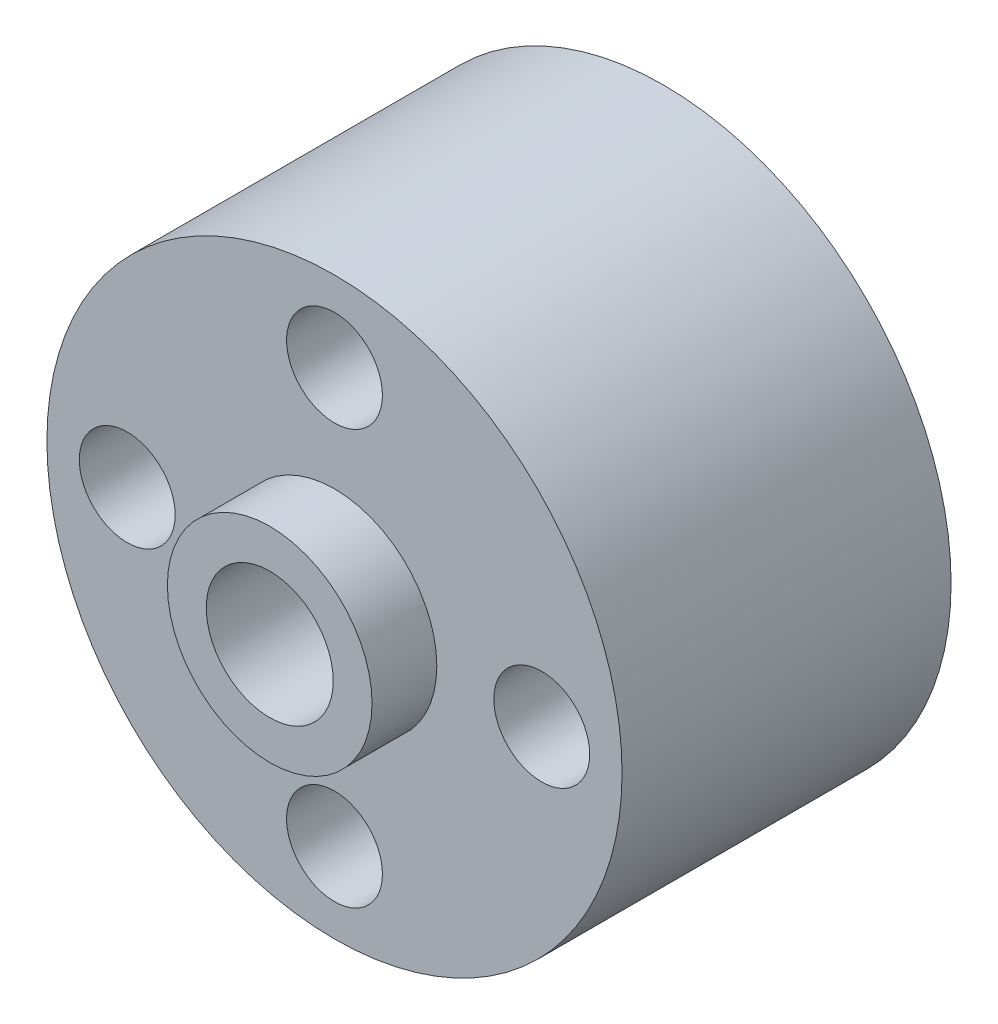
ISO-10303-21;
HEADER;
FILE_DESCRIPTION(('STEP AP214'),'2;1');
FILE_NAME('part.step','',(''),(''),'','','');
FILE_SCHEMA(('AUTOMOTIVE_DESIGN { 1 0 10303 214 1 1 1 1 }'));
ENDSEC;
DATA;
#1=APPLICATION_CONTEXT('core data for automotive mechanical design processes');
#2=APPLICATION_PROTOCOL_DEFINITION('international standard','automotive_design',2000,#1);
#3=PRODUCT_CONTEXT('',#1,'mechanical');
#4=PRODUCT('Part','Part','',(#3));
#5=PRODUCT_RELATED_PRODUCT_CATEGORY('part','',(#4));
#6=PRODUCT_DEFINITION_FORMATION('','',#4);
#7=PRODUCT_DEFINITION_CONTEXT('part definition',#1,'design');
#8=PRODUCT_DEFINITION('design','',#6,#7);
#9=PRODUCT_DEFINITION_SHAPE('','',#8);
#10=(LENGTH_UNIT() NAMED_UNIT(*) SI_UNIT(.MILLI.,.METRE.));
#11=(NAMED_UNIT(*) PLANE_ANGLE_UNIT() SI_UNIT($,.RADIAN.));
#12=(NAMED_UNIT(*) SI_UNIT($,.STERADIAN.) SOLID_ANGLE_UNIT());
#13=UNCERTAINTY_MEASURE_WITH_UNIT(LENGTH_MEASURE(1.E-05),#10,'distance_accuracy_value','');
#14=(GEOMETRIC_REPRESENTATION_CONTEXT(3) GLOBAL_UNCERTAINTY_ASSIGNED_CONTEXT((#13)) GLOBAL_UNIT_ASSIGNED_CONTEXT((#10,
#11,#12)) REPRESENTATION_CONTEXT('',''));
#15=CARTESIAN_POINT('',(0.,0.,0.));
#16=DIRECTION('',(0.,0.,1.));
#17=DIRECTION('',(1.,0.,0.));
#18=AXIS2_PLACEMENT_3D('',#15,#16,#17);
#19=CARTESIAN_POINT('',(0.,0.,-12.7));
#20=DIRECTION('',(0.,0.,1.));
#21=DIRECTION('',(1.,0.,0.));
#22=AXIS2_PLACEMENT_3D('',#19,#20,#21);
#23=PLANE('',#22);
#24=CARTESIAN_POINT('',(0.,0.,-12.7));
#25=DIRECTION('',(0.,0.,1.));
#26=DIRECTION('',(1.,0.,0.));
#27=AXIS2_PLACEMENT_3D('',#24,#25,#26);
#28=CIRCLE('',#27,11.1);
#29=CARTESIAN_POINT('',(11.1,0.,-12.7));
#30=VERTEX_POINT('',#29);
#31=EDGE_CURVE('E36',#30,#30,#28,.T.);
#32=ORIENTED_EDGE('',*,*,#31,.F.);
#33=EDGE_LOOP('',(#32));
#34=FACE_BOUND('',#33,.T.);
#35=CARTESIAN_POINT('',(8.,0.,-12.7));
#36=DIRECTION('',(0.,0.,1.));
#37=DIRECTION('',(1.,0.,0.));
#38=AXIS2_PLACEMENT_3D('',#35,#36,#37);
#39=CIRCLE('',#38,1.85);
#40=CARTESIAN_POINT('',(9.85,0.,-12.7));
#41=VERTEX_POINT('',#40);
#42=EDGE_CURVE('E45',#41,#41,#39,.T.);
#43=ORIENTED_EDGE('',*,*,#42,.T.);
#44=EDGE_LOOP('',(#43));
#45=FACE_BOUND('',#44,.T.);
#46=CARTESIAN_POINT('',(-8.,0.,-12.7));
#47=DIRECTION('',(0.,0.,1.));
#48=DIRECTION('',(1.,0.,0.));
#49=AXIS2_PLACEMENT_3D('',#46,#47,#48);
#50=CIRCLE('',#49,1.85);
#51=CARTESIAN_POINT('',(-6.15,0.,-12.7));
#52=VERTEX_POINT('',#51);
#53=EDGE_CURVE('E50',#52,#52,#50,.T.);
#54=ORIENTED_EDGE('',*,*,#53,.T.);
#55=EDGE_LOOP('',(#54));
#56=FACE_BOUND('',#55,.T.);
#57=CARTESIAN_POINT('',(0.,-8.,-12.7));
#58=DIRECTION('',(0.,0.,1.));
#59=DIRECTION('',(1.,0.,0.));
#60=AXIS2_PLACEMENT_3D('',#57,#58,#59);
#61=CIRCLE('',#60,1.85);
#62=CARTESIAN_POINT('',(1.85,-8.,-12.7));
#63=VERTEX_POINT('',#62);
#64=EDGE_CURVE('E56',#63,#63,#61,.T.);
#65=ORIENTED_EDGE('',*,*,#64,.T.);
#66=EDGE_LOOP('',(#65));
#67=FACE_BOUND('',#66,.T.);
#68=CARTESIAN_POINT('',(0.,8.,-12.7));
#69=DIRECTION('',(0.,0.,1.));
#70=DIRECTION('',(1.,0.,0.));
#71=AXIS2_PLACEMENT_3D('',#68,#69,#70);
#72=CIRCLE('',#71,1.85);
#73=CARTESIAN_POINT('',(1.85,8.,-12.7));
#74=VERTEX_POINT('',#73);
#75=EDGE_CURVE('E62',#74,#74,#72,.T.);
#76=ORIENTED_EDGE('',*,*,#75,.T.);
#77=EDGE_LOOP('',(#76));
#78=FACE_BOUND('',#77,.T.);
#79=CARTESIAN_POINT('',(0.,0.,-12.7));
#80=DIRECTION('',(0.,0.,1.));
#81=DIRECTION('',(1.,0.,0.));
#82=AXIS2_PLACEMENT_3D('',#79,#80,#81);
#83=CIRCLE('',#82,3.95);
#84=CARTESIAN_POINT('',(3.95,0.,-12.7));
#85=VERTEX_POINT('',#84);
#86=EDGE_CURVE('E10',#85,#85,#83,.F.);
#87=ORIENTED_EDGE('',*,*,#86,.F.);
#88=EDGE_LOOP('',(#87));
#89=FACE_BOUND('',#88,.T.);
#90=ADVANCED_FACE('F29',(#34,#45,#56,#67,#78,#89),#23,.F.);
#91=CARTESIAN_POINT('',(0.,0.,0.));
#92=DIRECTION('',(0.,0.,1.));
#93=DIRECTION('',(1.,0.,0.));
#94=AXIS2_PLACEMENT_3D('',#91,#92,#93);
#95=PLANE('',#94);
#96=CARTESIAN_POINT('',(0.,0.,0.));
#97=DIRECTION('',(0.,0.,1.));
#98=DIRECTION('',(1.,0.,0.));
#99=AXIS2_PLACEMENT_3D('',#96,#97,#98);
#100=CIRCLE('',#99,11.1);
#101=CARTESIAN_POINT('',(11.1,0.,0.));
#102=VERTEX_POINT('',#101);
#103=EDGE_CURVE('E40',#102,#102,#100,.T.);
#104=ORIENTED_EDGE('',*,*,#103,.T.);
#105=EDGE_LOOP('',(#104));
#106=FACE_BOUND('',#105,.T.);
#107=CARTESIAN_POINT('',(8.,0.,0.));
#108=DIRECTION('',(0.,0.,1.));
#109=DIRECTION('',(1.,0.,0.));
#110=AXIS2_PLACEMENT_3D('',#107,#108,#109);
#111=CIRCLE('',#110,1.85);
#112=CARTESIAN_POINT('',(9.85,0.,0.));
#113=VERTEX_POINT('',#112);
#114=EDGE_CURVE('E47',#113,#113,#111,.T.);
#115=ORIENTED_EDGE('',*,*,#114,.F.);
#116=EDGE_LOOP('',(#115));
#117=FACE_BOUND('',#116,.T.);
#118=CARTESIAN_POINT('',(-8.,0.,0.));
#119=DIRECTION('',(0.,0.,1.));
#120=DIRECTION('',(1.,0.,0.));
#121=AXIS2_PLACEMENT_3D('',#118,#119,#120);
#122=CIRCLE('',#121,1.85);
#123=CARTESIAN_POINT('',(-6.15,0.,0.));
#124=VERTEX_POINT('',#123);
#125=EDGE_CURVE('E53',#124,#124,#122,.T.);
#126=ORIENTED_EDGE('',*,*,#125,.F.);
#127=EDGE_LOOP('',(#126));
#128=FACE_BOUND('',#127,.T.);
#129=CARTESIAN_POINT('',(0.,-8.,0.));
#130=DIRECTION('',(0.,0.,1.));
#131=DIRECTION('',(1.,0.,0.));
#132=AXIS2_PLACEMENT_3D('',#129,#130,#131);
#133=CIRCLE('',#132,1.85);
#134=CARTESIAN_POINT('',(1.85,-8.,0.));
#135=VERTEX_POINT('',#134);
#136=EDGE_CURVE('E59',#135,#135,#133,.T.);
#137=ORIENTED_EDGE('',*,*,#136,.F.);
#138=EDGE_LOOP('',(#137));
#139=FACE_BOUND('',#138,.T.);
#140=CARTESIAN_POINT('',(0.,8.,0.));
#141=DIRECTION('',(0.,0.,1.));
#142=DIRECTION('',(1.,0.,0.));
#143=AXIS2_PLACEMENT_3D('',#140,#141,#142);
#144=CIRCLE('',#143,1.85);
#145=CARTESIAN_POINT('',(1.85,8.,0.));
#146=VERTEX_POINT('',#145);
#147=EDGE_CURVE('E65',#146,#146,#144,.T.);
#148=ORIENTED_EDGE('',*,*,#147,.F.);
#149=EDGE_LOOP('',(#148));
#150=FACE_BOUND('',#149,.T.);
#151=CARTESIAN_POINT('',(0.,0.,0.));
#152=DIRECTION('',(0.,0.,1.));
#153=DIRECTION('',(1.,0.,0.));
#154=AXIS2_PLACEMENT_3D('',#151,#152,#153);
#155=CIRCLE('',#154,3.95);
#156=CARTESIAN_POINT('',(3.95,0.,0.));
#157=VERTEX_POINT('',#156);
#158=EDGE_CURVE('E71',#157,#157,#155,.T.);
#159=ORIENTED_EDGE('',*,*,#158,.F.);
#160=EDGE_LOOP('',(#159));
#161=FACE_BOUND('',#160,.T.);
#162=ADVANCED_FACE('F109',(#106,#117,#128,#139,#150,#161),#95,.T.);
#163=CARTESIAN_POINT('',(0.,0.,-12.7));
#164=DIRECTION('',(0.,0.,1.));
#165=DIRECTION('',(1.,0.,0.));
#166=AXIS2_PLACEMENT_3D('',#163,#164,#165);
#167=CYLINDRICAL_SURFACE('',#166,11.1);
#168=ORIENTED_EDGE('',*,*,#31,.T.);
#169=EDGE_LOOP('',(#168));
#170=FACE_BOUND('',#169,.T.);
#171=ORIENTED_EDGE('',*,*,#103,.F.);
#172=EDGE_LOOP('',(#171));
#173=FACE_BOUND('',#172,.T.);
#174=ADVANCED_FACE('F31',(#170,#173),#167,.T.);
#175=CARTESIAN_POINT('',(8.,0.,-12.7));
#176=DIRECTION('',(0.,0.,1.));
#177=DIRECTION('',(1.,0.,0.));
#178=AXIS2_PLACEMENT_3D('',#175,#176,#177);
#179=CYLINDRICAL_SURFACE('',#178,1.85);
#180=ORIENTED_EDGE('',*,*,#42,.F.);
#181=EDGE_LOOP('',(#180));
#182=FACE_BOUND('',#181,.T.);
#183=ORIENTED_EDGE('',*,*,#114,.T.);
#184=EDGE_LOOP('',(#183));
#185=FACE_BOUND('',#184,.T.);
#186=ADVANCED_FACE('F116',(#182,#185),#179,.F.);
#187=CARTESIAN_POINT('',(-8.,0.,-12.7));
#188=DIRECTION('',(0.,0.,1.));
#189=DIRECTION('',(1.,0.,0.));
#190=AXIS2_PLACEMENT_3D('',#187,#188,#189);
#191=CYLINDRICAL_SURFACE('',#190,1.85);
#192=ORIENTED_EDGE('',*,*,#53,.F.);
#193=EDGE_LOOP('',(#192));
#194=FACE_BOUND('',#193,.T.);
#195=ORIENTED_EDGE('',*,*,#125,.T.);
#196=EDGE_LOOP('',(#195));
#197=FACE_BOUND('',#196,.T.);
#198=ADVANCED_FACE('F123',(#194,#197),#191,.F.);
#199=CARTESIAN_POINT('',(0.,-8.,-12.7));
#200=DIRECTION('',(0.,0.,1.));
#201=DIRECTION('',(1.,0.,0.));
#202=AXIS2_PLACEMENT_3D('',#199,#200,#201);
#203=CYLINDRICAL_SURFACE('',#202,1.85);
#204=ORIENTED_EDGE('',*,*,#64,.F.);
#205=EDGE_LOOP('',(#204));
#206=FACE_BOUND('',#205,.T.);
#207=ORIENTED_EDGE('',*,*,#136,.T.);
#208=EDGE_LOOP('',(#207));
#209=FACE_BOUND('',#208,.T.);
#210=ADVANCED_FACE('F127',(#206,#209),#203,.F.);
#211=CARTESIAN_POINT('',(0.,8.,-12.7));
#212=DIRECTION('',(0.,0.,1.));
#213=DIRECTION('',(1.,0.,0.));
#214=AXIS2_PLACEMENT_3D('',#211,#212,#213);
#215=CYLINDRICAL_SURFACE('',#214,1.85);
#216=ORIENTED_EDGE('',*,*,#75,.F.);
#217=EDGE_LOOP('',(#216));
#218=FACE_BOUND('',#217,.T.);
#219=ORIENTED_EDGE('',*,*,#147,.T.);
#220=EDGE_LOOP('',(#219));
#221=FACE_BOUND('',#220,.T.);
#222=ADVANCED_FACE('F105',(#218,#221),#215,.F.);
#223=CARTESIAN_POINT('',(0.,0.,2.5));
#224=DIRECTION('',(0.,0.,-1.));
#225=DIRECTION('',(-1.,0.,0.));
#226=AXIS2_PLACEMENT_3D('',#223,#224,#225);
#227=CYLINDRICAL_SURFACE('',#226,3.95);
#228=CARTESIAN_POINT('',(0.,0.,2.5));
#229=DIRECTION('',(0.,0.,1.));
#230=DIRECTION('',(1.,0.,0.));
#231=AXIS2_PLACEMENT_3D('',#228,#229,#230);
#232=CIRCLE('',#231,3.95);
#233=CARTESIAN_POINT('',(3.95,0.,2.5));
#234=VERTEX_POINT('',#233);
#235=EDGE_CURVE('E68',#234,#234,#232,.T.);
#236=ORIENTED_EDGE('',*,*,#235,.F.);
#237=EDGE_LOOP('',(#236));
#238=FACE_BOUND('',#237,.T.);
#239=ORIENTED_EDGE('',*,*,#158,.T.);
#240=EDGE_LOOP('',(#239));
#241=FACE_BOUND('',#240,.T.);
#242=ADVANCED_FACE('F99',(#238,#241),#227,.T.);
#243=CARTESIAN_POINT('',(0.,0.,2.5));
#244=DIRECTION('',(0.,0.,1.));
#245=DIRECTION('',(1.,0.,0.));
#246=AXIS2_PLACEMENT_3D('',#243,#244,#245);
#247=PLANE('',#246);
#248=CARTESIAN_POINT('',(0.,0.,2.5));
#249=DIRECTION('',(0.,0.,1.));
#250=DIRECTION('',(1.,0.,0.));
#251=AXIS2_PLACEMENT_3D('',#248,#249,#250);
#252=CIRCLE('',#251,2.45);
#253=CARTESIAN_POINT('',(2.45,0.,2.5));
#254=VERTEX_POINT('',#253);
#255=EDGE_CURVE('E80',#254,#254,#252,.T.);
#256=ORIENTED_EDGE('',*,*,#255,.F.);
#257=EDGE_LOOP('',(#256));
#258=FACE_BOUND('',#257,.T.);
#259=ORIENTED_EDGE('',*,*,#235,.T.);
#260=EDGE_LOOP('',(#259));
#261=FACE_BOUND('',#260,.T.);
#262=ADVANCED_FACE('F95',(#258,#261),#247,.T.);
#263=CARTESIAN_POINT('',(0.,0.,-15.2));
#264=DIRECTION('',(0.,0.,1.));
#265=DIRECTION('',(1.,0.,0.));
#266=AXIS2_PLACEMENT_3D('',#263,#264,#265);
#267=CYLINDRICAL_SURFACE('',#266,3.95);
#268=CARTESIAN_POINT('',(0.,0.,-15.2));
#269=DIRECTION('',(0.,0.,-1.));
#270=DIRECTION('',(-1.,0.,0.));
#271=AXIS2_PLACEMENT_3D('',#268,#269,#270);
#272=CIRCLE('',#271,3.95);
#273=CARTESIAN_POINT('',(-3.95,0.,-15.2));
#274=VERTEX_POINT('',#273);
#275=EDGE_CURVE('E74',#274,#274,#272,.T.);
#276=ORIENTED_EDGE('',*,*,#275,.F.);
#277=EDGE_LOOP('',(#276));
#278=FACE_BOUND('',#277,.T.);
#279=ORIENTED_EDGE('',*,*,#86,.T.);
#280=EDGE_LOOP('',(#279));
#281=FACE_BOUND('',#280,.T.);
#282=ADVANCED_FACE('F98',(#278,#281),#267,.T.);
#283=CARTESIAN_POINT('',(0.,0.,-15.2));
#284=DIRECTION('',(0.,0.,-1.));
#285=DIRECTION('',(-1.,0.,0.));
#286=AXIS2_PLACEMENT_3D('',#283,#284,#285);
#287=PLANE('',#286);
#288=CARTESIAN_POINT('',(0.,0.,-15.2));
#289=DIRECTION('',(0.,0.,1.));
#290=DIRECTION('',(1.,0.,0.));
#291=AXIS2_PLACEMENT_3D('',#288,#289,#290);
#292=CIRCLE('',#291,2.45);
#293=CARTESIAN_POINT('',(2.45,0.,-15.2));
#294=VERTEX_POINT('',#293);
#295=EDGE_CURVE('E79',#294,#294,#292,.T.);
#296=ORIENTED_EDGE('',*,*,#295,.T.);
#297=EDGE_LOOP('',(#296));
#298=FACE_BOUND('',#297,.T.);
#299=ORIENTED_EDGE('',*,*,#275,.T.);
#300=EDGE_LOOP('',(#299));
#301=FACE_BOUND('',#300,.T.);
#302=ADVANCED_FACE('F86',(#298,#301),#287,.T.);
#303=CARTESIAN_POINT('',(0.,0.,-15.2));
#304=DIRECTION('',(0.,0.,1.));
#305=DIRECTION('',(1.,0.,0.));
#306=AXIS2_PLACEMENT_3D('',#303,#304,#305);
#307=CYLINDRICAL_SURFACE('',#306,2.45);
#308=ORIENTED_EDGE('',*,*,#295,.F.);
#309=EDGE_LOOP('',(#308));
#310=FACE_BOUND('',#309,.T.);
#311=ORIENTED_EDGE('',*,*,#255,.T.);
#312=EDGE_LOOP('',(#311));
#313=FACE_BOUND('',#312,.T.);
#314=ADVANCED_FACE('F89',(#310,#313),#307,.F.);
#315=CLOSED_SHELL('',(#90,#162,#174,#186,#198,#210,#222,#242,#262,#282,#302,#314));
#316=MANIFOLD_SOLID_BREP('B2',#315);
#317=ADVANCED_BREP_SHAPE_REPRESENTATION('',(#18,#316),#14);
#318=SHAPE_DEFINITION_REPRESENTATION(#9,#317);
ENDSEC;
END-ISO-10303-21;
